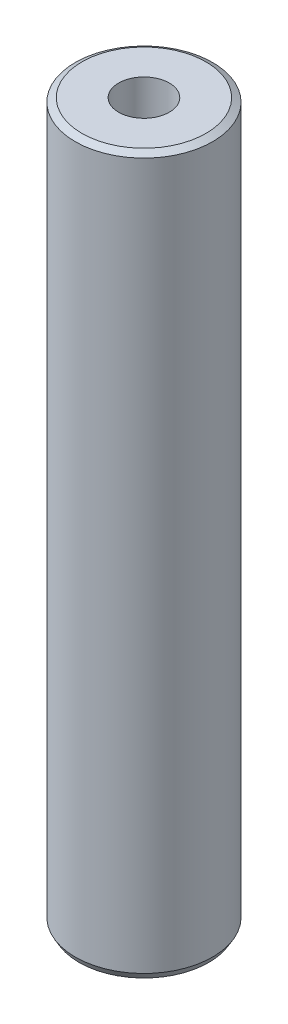
ISO-10303-21;
HEADER;
FILE_DESCRIPTION(('STEP AP214'),'2;1');
FILE_NAME('part.step','',(''),(''),'','','');
FILE_SCHEMA(('AUTOMOTIVE_DESIGN { 1 0 10303 214 1 1 1 1 }'));
ENDSEC;
DATA;
#1=APPLICATION_CONTEXT('core data for automotive mechanical design processes');
#2=APPLICATION_PROTOCOL_DEFINITION('international standard','automotive_design',2000,#1);
#3=PRODUCT_CONTEXT('',#1,'mechanical');
#4=PRODUCT('Part','Part','',(#3));
#5=PRODUCT_RELATED_PRODUCT_CATEGORY('part','',(#4));
#6=PRODUCT_DEFINITION_FORMATION('','',#4);
#7=PRODUCT_DEFINITION_CONTEXT('part definition',#1,'design');
#8=PRODUCT_DEFINITION('design','',#6,#7);
#9=PRODUCT_DEFINITION_SHAPE('','',#8);
#10=(LENGTH_UNIT() NAMED_UNIT(*) SI_UNIT(.MILLI.,.METRE.));
#11=(NAMED_UNIT(*) PLANE_ANGLE_UNIT() SI_UNIT($,.RADIAN.));
#12=(NAMED_UNIT(*) SI_UNIT($,.STERADIAN.) SOLID_ANGLE_UNIT());
#13=UNCERTAINTY_MEASURE_WITH_UNIT(LENGTH_MEASURE(1.E-05),#10,'distance_accuracy_value','');
#14=(GEOMETRIC_REPRESENTATION_CONTEXT(3) GLOBAL_UNCERTAINTY_ASSIGNED_CONTEXT((#13)) GLOBAL_UNIT_ASSIGNED_CONTEXT((#10,
#11,#12)) REPRESENTATION_CONTEXT('',''));
#15=CARTESIAN_POINT('',(0.,0.,0.));
#16=DIRECTION('',(0.,0.,1.));
#17=DIRECTION('',(1.,0.,0.));
#18=AXIS2_PLACEMENT_3D('',#15,#16,#17);
#19=CARTESIAN_POINT('',(0.,600.,0.));
#20=DIRECTION('',(0.,-1.,0.));
#21=DIRECTION('',(0.,0.,-1.));
#22=AXIS2_PLACEMENT_3D('',#19,#20,#21);
#23=CYLINDRICAL_SURFACE('',#22,57.5);
#24=CARTESIAN_POINT('',(0.,596.779836504374,0.));
#25=DIRECTION('',(0.,1.,0.));
#26=DIRECTION('',(0.,0.,1.));
#27=AXIS2_PLACEMENT_3D('',#24,#25,#26);
#28=CIRCLE('',#27,57.5);
#29=CARTESIAN_POINT('',(0.,596.779836504374,57.5));
#30=VERTEX_POINT('',#29);
#31=EDGE_CURVE('E50',#30,#30,#28,.F.);
#32=ORIENTED_EDGE('',*,*,#31,.T.);
#33=EDGE_LOOP('',(#32));
#34=FACE_BOUND('',#33,.T.);
#35=CARTESIAN_POINT('',(0.,5.57748678310344,0.));
#36=DIRECTION('',(0.,1.,0.));
#37=DIRECTION('',(0.,0.,1.));
#38=AXIS2_PLACEMENT_3D('',#35,#36,#37);
#39=CIRCLE('',#38,57.5);
#40=CARTESIAN_POINT('',(0.,5.57748678310344,57.5));
#41=VERTEX_POINT('',#40);
#42=EDGE_CURVE('E51',#41,#41,#39,.T.);
#43=ORIENTED_EDGE('',*,*,#42,.T.);
#44=EDGE_LOOP('',(#43));
#45=FACE_BOUND('',#44,.T.);
#46=ADVANCED_FACE('F39',(#34,#45),#23,.T.);
#47=CARTESIAN_POINT('',(0.,600.,0.));
#48=DIRECTION('',(0.,1.,0.));
#49=DIRECTION('',(0.,0.,1.));
#50=AXIS2_PLACEMENT_3D('',#47,#48,#49);
#51=PLANE('',#50);
#52=CARTESIAN_POINT('',(0.,600.,0.));
#53=DIRECTION('',(0.,1.,0.));
#54=DIRECTION('',(0.,0.,1.));
#55=AXIS2_PLACEMENT_3D('',#52,#53,#54);
#56=CIRCLE('',#55,51.9225132168966);
#57=CARTESIAN_POINT('',(0.,600.,51.9225132168966));
#58=VERTEX_POINT('',#57);
#59=EDGE_CURVE('E54',#58,#58,#56,.T.);
#60=ORIENTED_EDGE('',*,*,#59,.T.);
#61=EDGE_LOOP('',(#60));
#62=FACE_BOUND('',#61,.T.);
#63=CARTESIAN_POINT('',(0.,600.,0.));
#64=DIRECTION('',(0.,1.,0.));
#65=DIRECTION('',(0.,0.,1.));
#66=AXIS2_PLACEMENT_3D('',#63,#64,#65);
#67=CIRCLE('',#66,21.2207805136112);
#68=CARTESIAN_POINT('',(0.,600.,21.2207805136112));
#69=VERTEX_POINT('',#68);
#70=EDGE_CURVE('E58',#69,#69,#67,.T.);
#71=ORIENTED_EDGE('',*,*,#70,.F.);
#72=EDGE_LOOP('',(#71));
#73=FACE_BOUND('',#72,.T.);
#74=ADVANCED_FACE('F69',(#62,#73),#51,.T.);
#75=CARTESIAN_POINT('',(0.,0.,0.));
#76=DIRECTION('',(0.,1.,0.));
#77=DIRECTION('',(0.,0.,1.));
#78=AXIS2_PLACEMENT_3D('',#75,#76,#77);
#79=PLANE('',#78);
#80=CARTESIAN_POINT('',(0.,0.,0.));
#81=DIRECTION('',(0.,1.,0.));
#82=DIRECTION('',(0.,0.,1.));
#83=AXIS2_PLACEMENT_3D('',#80,#81,#82);
#84=CIRCLE('',#83,54.2798365043736);
#85=CARTESIAN_POINT('',(0.,0.,54.2798365043736));
#86=VERTEX_POINT('',#85);
#87=EDGE_CURVE('E10',#86,#86,#84,.F.);
#88=ORIENTED_EDGE('',*,*,#87,.T.);
#89=EDGE_LOOP('',(#88));
#90=FACE_BOUND('',#89,.T.);
#91=CARTESIAN_POINT('',(0.,0.,0.));
#92=DIRECTION('',(0.,1.,0.));
#93=DIRECTION('',(0.,0.,1.));
#94=AXIS2_PLACEMENT_3D('',#91,#92,#93);
#95=CIRCLE('',#94,21.2207805136112);
#96=CARTESIAN_POINT('',(0.,0.,21.2207805136112));
#97=VERTEX_POINT('',#96);
#98=EDGE_CURVE('E63',#97,#97,#95,.T.);
#99=ORIENTED_EDGE('',*,*,#98,.T.);
#100=EDGE_LOOP('',(#99));
#101=FACE_BOUND('',#100,.T.);
#102=ADVANCED_FACE('F75',(#90,#101),#79,.F.);
#103=CARTESIAN_POINT('',(0.,600.,0.));
#104=DIRECTION('',(0.,-1.,0.));
#105=DIRECTION('',(0.,0.,-1.));
#106=AXIS2_PLACEMENT_3D('',#103,#104,#105);
#107=CYLINDRICAL_SURFACE('',#106,21.2207805136112);
#108=ORIENTED_EDGE('',*,*,#70,.T.);
#109=EDGE_LOOP('',(#108));
#110=FACE_BOUND('',#109,.T.);
#111=ORIENTED_EDGE('',*,*,#98,.F.);
#112=EDGE_LOOP('',(#111));
#113=FACE_BOUND('',#112,.T.);
#114=ADVANCED_FACE('F70',(#110,#113),#107,.F.);
#115=CARTESIAN_POINT('',(0.,600.,0.));
#116=DIRECTION('',(0.,-1.,0.));
#117=DIRECTION('',(0.,0.,-1.));
#118=AXIS2_PLACEMENT_3D('',#115,#116,#117);
#119=CONICAL_SURFACE('',#118,51.9225132168966,1.0471975511966);
#120=ORIENTED_EDGE('',*,*,#31,.F.);
#121=EDGE_LOOP('',(#120));
#122=FACE_BOUND('',#121,.T.);
#123=ORIENTED_EDGE('',*,*,#59,.F.);
#124=EDGE_LOOP('',(#123));
#125=FACE_BOUND('',#124,.T.);
#126=ADVANCED_FACE('F81',(#122,#125),#119,.T.);
#127=CARTESIAN_POINT('',(0.,5.57748678310344,0.));
#128=DIRECTION('',(0.,1.,0.));
#129=DIRECTION('',(0.,0.,1.));
#130=AXIS2_PLACEMENT_3D('',#127,#128,#129);
#131=CONICAL_SURFACE('',#130,57.5,0.523598775598303);
#132=CARTESIAN_POINT('',(0.,0.,54.2798365043736));
#133=CARTESIAN_POINT('',(0.,0.0580988206573266,54.3133798741197));
#134=CARTESIAN_POINT('',(0.,0.116197641314654,54.3469232438658));
#135=CARTESIAN_POINT('',(0.,0.232395282629309,54.4140099833581));
#136=CARTESIAN_POINT('',(0.,0.290494103286636,54.4475533531042));
#137=CARTESIAN_POINT('',(0.,0.406691744601291,54.5146400925964));
#138=CARTESIAN_POINT('',(0.,0.464790565258619,54.5481834623425));
#139=CARTESIAN_POINT('',(0.,0.580988206573274,54.6152702018347));
#140=CARTESIAN_POINT('',(0.,0.639087027230601,54.6488135715808));
#141=CARTESIAN_POINT('',(0.,0.755284668545256,54.715900311073));
#142=CARTESIAN_POINT('',(0.,0.813383489202584,54.7494436808191));
#143=CARTESIAN_POINT('',(0.,0.929581130517238,54.8165304203114));
#144=CARTESIAN_POINT('',(0.,0.987679951174566,54.8500737900575));
#145=CARTESIAN_POINT('',(0.,1.10387759248922,54.9171605295497));
#146=CARTESIAN_POINT('',(0.,1.16197641314655,54.9507038992958));
#147=CARTESIAN_POINT('',(0.,1.2781740544612,55.017790638788));
#148=CARTESIAN_POINT('',(0.,1.33627287511853,55.0513340085341));
#149=CARTESIAN_POINT('',(0.,1.45247051643319,55.1184207480263));
#150=CARTESIAN_POINT('',(0.,1.51056933709051,55.1519641177724));
#151=CARTESIAN_POINT('',(0.,1.62676697840517,55.2190508572646));
#152=CARTESIAN_POINT('',(0.,1.6848657990625,55.2525942270108));
#153=CARTESIAN_POINT('',(0.,1.80106344037715,55.319680966503));
#154=CARTESIAN_POINT('',(0.,1.85916226103448,55.3532243362491));
#155=CARTESIAN_POINT('',(0.,1.97535990234913,55.4203110757413));
#156=CARTESIAN_POINT('',(0.,2.03345872300646,55.4538544454874));
#157=CARTESIAN_POINT('',(0.,2.14965636432112,55.5209411849796));
#158=CARTESIAN_POINT('',(0.,2.20775518497844,55.5544845547257));
#159=CARTESIAN_POINT('',(0.,2.3239528262931,55.6215712942179));
#160=CARTESIAN_POINT('',(0.,2.38205164695042,55.6551146639641));
#161=CARTESIAN_POINT('',(0.,2.49824928826508,55.7222014034563));
#162=CARTESIAN_POINT('',(0.,2.55634810892241,55.7557447732024));
#163=CARTESIAN_POINT('',(0.,2.67254575023706,55.8228315126946));
#164=CARTESIAN_POINT('',(0.,2.73064457089439,55.8563748824407));
#165=CARTESIAN_POINT('',(0.,2.84684221220905,55.9234616219329));
#166=CARTESIAN_POINT('',(0.,2.90494103286637,55.957004991679));
#167=CARTESIAN_POINT('',(0.,3.02113867418103,56.0240917311712));
#168=CARTESIAN_POINT('',(0.,3.07923749483836,56.0576351009174));
#169=CARTESIAN_POINT('',(0.,3.19543513615301,56.1247218404096));
#170=CARTESIAN_POINT('',(0.,3.25353395681034,56.1582652101557));
#171=CARTESIAN_POINT('',(0.,3.36973159812499,56.2253519496479));
#172=CARTESIAN_POINT('',(0.,3.42783041878232,56.258895319394));
#173=CARTESIAN_POINT('',(0.,3.54402806009697,56.3259820588862));
#174=CARTESIAN_POINT('',(0.,3.6021268807543,56.3595254286323));
#175=CARTESIAN_POINT('',(0.,3.71832452206896,56.4266121681245));
#176=CARTESIAN_POINT('',(0.,3.77642334272628,56.4601555378707));
#177=CARTESIAN_POINT('',(0.,3.89262098404094,56.5272422773629));
#178=CARTESIAN_POINT('',(0.,3.95071980469827,56.560785647109));
#179=CARTESIAN_POINT('',(0.,4.06691744601292,56.6278723866012));
#180=CARTESIAN_POINT('',(0.,4.12501626667025,56.6614157563473));
#181=CARTESIAN_POINT('',(0.,4.2412139079849,56.7285024958395));
#182=CARTESIAN_POINT('',(0.,4.29931272864223,56.7620458655856));
#183=CARTESIAN_POINT('',(0.,4.41551036995689,56.8291326050778));
#184=CARTESIAN_POINT('',(0.,4.47360919061421,56.862675974824));
#185=CARTESIAN_POINT('',(0.,4.58980683192887,56.9297627143162));
#186=CARTESIAN_POINT('',(0.,4.6479056525862,56.9633060840623));
#187=CARTESIAN_POINT('',(0.,4.76410329390085,57.0303928235545));
#188=CARTESIAN_POINT('',(0.,4.82220211455818,57.0639361933006));
#189=CARTESIAN_POINT('',(0.,4.93839975587283,57.1310229327928));
#190=CARTESIAN_POINT('',(0.,4.99649857653016,57.1645663025389));
#191=CARTESIAN_POINT('',(0.,5.11269621784482,57.2316530420311));
#192=CARTESIAN_POINT('',(0.,5.17079503850214,57.2651964117772));
#193=CARTESIAN_POINT('',(0.,5.2869926798168,57.3322831512695));
#194=CARTESIAN_POINT('',(0.,5.34509150047413,57.3658265210156));
#195=CARTESIAN_POINT('',(0.,5.46128914178878,57.4329132605078));
#196=CARTESIAN_POINT('',(0.,5.51938796244611,57.4664566302539));
#197=CARTESIAN_POINT('',(0.,5.57748678310344,57.5));
#198=B_SPLINE_CURVE_WITH_KNOTS('',3,(#132,#133,#134,#135,#136,#137,#138,#139,#140,#141,#142,
#143,#144,#145,#146,#147,#148,#149,#150,#151,#152,#153,#154,#155,#156,#157,#158,#159,#160,#161,
#162,#163,#164,#165,#166,#167,#168,#169,#170,#171,#172,#173,#174,#175,#176,#177,#178,#179,#180,
#181,#182,#183,#184,#185,#186,#187,#188,#189,#190,#191,#192,#193,#194,#195,#196,#197),
.UNSPECIFIED.,.F.,.F.,(4,2,2,2,2,2,2,2,2,2,2,2,2,2,2,2,2,2,2,2,2,2,2,2,2,2,2,2,2,2,2,2,4),(0.,
0.201260218476647,0.402520436953294,0.603780655429942,0.805040873906589,1.00630109238324,
1.20756131085988,1.40882152933653,1.61008174781318,1.81134196628982,2.01260218476647,
2.21386240324312,2.41512262171977,2.61638284019641,2.81764305867306,3.01890327714971,
3.22016349562636,3.421423714103,3.62268393257965,3.8239441510563,4.02520436953295,
4.2264645880096,4.42772480648624,4.62898502496289,4.83024524343954,5.03150546191619,
5.23276568039283,5.43402589886948,5.63528611734613,5.83654633582278,6.03780655429942,
6.23906677277607,6.44032699125272),.UNSPECIFIED.);
#199=EDGE_CURVE('BSEAM45',#86,#41,#198,.T.);
#200=ORIENTED_EDGE('',*,*,#87,.F.);
#201=ORIENTED_EDGE('',*,*,#42,.F.);
#202=ORIENTED_EDGE('',*,*,#199,.T.);
#203=ORIENTED_EDGE('',*,*,#199,.F.);
#204=EDGE_LOOP('',(#200,#202,#201,#203));
#205=FACE_BOUND('',#204,.T.);
#206=ADVANCED_FACE('F45',(#205),#131,.T.);
#207=CLOSED_SHELL('',(#46,#74,#102,#114,#126,#206));
#208=MANIFOLD_SOLID_BREP('B2',#207);
#209=ADVANCED_BREP_SHAPE_REPRESENTATION('',(#18,#208),#14);
#210=SHAPE_DEFINITION_REPRESENTATION(#9,#209);
ENDSEC;
END-ISO-10303-21;
